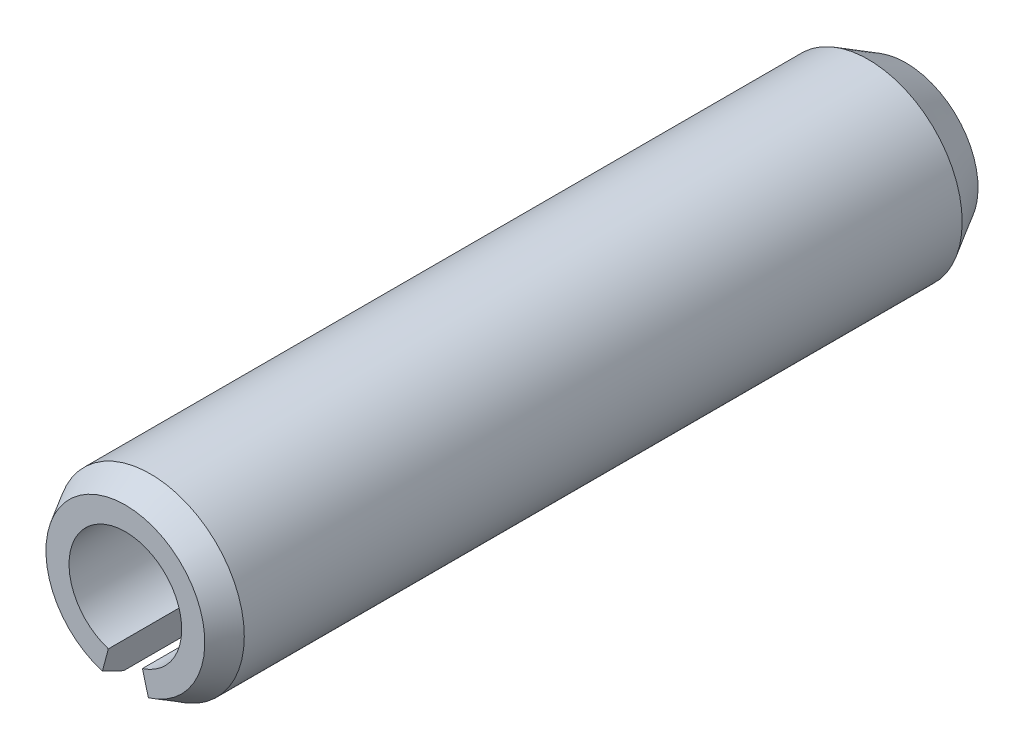
ISO-10303-21;
HEADER;
FILE_DESCRIPTION(('STEP AP214'),'2;1');
FILE_NAME('part.step','',(''),(''),'','','');
FILE_SCHEMA(('AUTOMOTIVE_DESIGN { 1 0 10303 214 1 1 1 1 }'));
ENDSEC;
DATA;
#1=APPLICATION_CONTEXT('core data for automotive mechanical design processes');
#2=APPLICATION_PROTOCOL_DEFINITION('international standard','automotive_design',2000,#1);
#3=PRODUCT_CONTEXT('',#1,'mechanical');
#4=PRODUCT('Part','Part','',(#3));
#5=PRODUCT_RELATED_PRODUCT_CATEGORY('part','',(#4));
#6=PRODUCT_DEFINITION_FORMATION('','',#4);
#7=PRODUCT_DEFINITION_CONTEXT('part definition',#1,'design');
#8=PRODUCT_DEFINITION('design','',#6,#7);
#9=PRODUCT_DEFINITION_SHAPE('','',#8);
#10=(LENGTH_UNIT() NAMED_UNIT(*) SI_UNIT(.MILLI.,.METRE.));
#11=(NAMED_UNIT(*) PLANE_ANGLE_UNIT() SI_UNIT($,.RADIAN.));
#12=(NAMED_UNIT(*) SI_UNIT($,.STERADIAN.) SOLID_ANGLE_UNIT());
#13=UNCERTAINTY_MEASURE_WITH_UNIT(LENGTH_MEASURE(1.E-05),#10,'distance_accuracy_value','');
#14=(GEOMETRIC_REPRESENTATION_CONTEXT(3) GLOBAL_UNCERTAINTY_ASSIGNED_CONTEXT((#13)) GLOBAL_UNIT_ASSIGNED_CONTEXT((#10,
#11,#12)) REPRESENTATION_CONTEXT('',''));
#15=CARTESIAN_POINT('',(0.,0.,0.));
#16=DIRECTION('',(0.,0.,1.));
#17=DIRECTION('',(1.,0.,0.));
#18=AXIS2_PLACEMENT_3D('',#15,#16,#17);
#19=CARTESIAN_POINT('',(0.,0.,25.));
#20=DIRECTION('',(0.,0.,-1.));
#21=DIRECTION('',(-1.,0.,0.));
#22=AXIS2_PLACEMENT_3D('',#19,#20,#21);
#23=CYLINDRICAL_SURFACE('',#22,3.);
#24=DIRECTION('',(0.,0.,-1.));
#25=VECTOR('',#24,1.);
#26=CARTESIAN_POINT('',(0.85488871162423,-2.8756156368224,25.));
#27=LINE('',#26,#25);
#28=CARTESIAN_POINT('',(0.85488871162423,-2.8756156368224,24.2));
#29=VERTEX_POINT('',#28);
#30=CARTESIAN_POINT('',(0.85488871162423,-2.8756156368224,1.26188021535174));
#31=VERTEX_POINT('',#30);
#32=EDGE_CURVE('E128',#29,#31,#27,.T.);
#33=ORIENTED_EDGE('',*,*,#32,.T.);
#34=CARTESIAN_POINT('',(0.,0.,1.26188021535174));
#35=DIRECTION('',(0.,0.,-1.));
#36=DIRECTION('',(-1.,0.,0.));
#37=AXIS2_PLACEMENT_3D('',#34,#35,#36);
#38=CIRCLE('',#37,3.);
#39=CARTESIAN_POINT('',(-0.85488871162424,-2.87561563682241,1.26188021535174));
#40=VERTEX_POINT('',#39);
#41=EDGE_CURVE('E181',#31,#40,#38,.F.);
#42=ORIENTED_EDGE('',*,*,#41,.T.);
#43=DIRECTION('',(0.,0.,-1.));
#44=VECTOR('',#43,1.);
#45=CARTESIAN_POINT('',(-0.85488871162424,-2.87561563682241,25.));
#46=LINE('',#45,#44);
#47=CARTESIAN_POINT('',(-0.85488871162424,-2.87561563682241,24.2));
#48=VERTEX_POINT('',#47);
#49=EDGE_CURVE('E107',#48,#40,#46,.T.);
#50=ORIENTED_EDGE('',*,*,#49,.F.);
#51=CARTESIAN_POINT('',(0.,0.,24.2));
#52=DIRECTION('',(0.,0.,1.));
#53=DIRECTION('',(1.,0.,0.));
#54=AXIS2_PLACEMENT_3D('',#51,#52,#53);
#55=CIRCLE('',#54,3.);
#56=EDGE_CURVE('E143',#48,#29,#55,.F.);
#57=ORIENTED_EDGE('',*,*,#56,.T.);
#58=EDGE_LOOP('',(#33,#42,#50,#57));
#59=FACE_BOUND('',#58,.T.);
#60=ADVANCED_FACE('F32',(#59),#23,.T.);
#61=CARTESIAN_POINT('',(-0.544114673264127,-1.71579113598909,25.));
#62=DIRECTION('',(0.965925826289069,-0.258819045102521,0.));
#63=DIRECTION('',(0.258819045102521,0.965925826289069,0.));
#64=AXIS2_PLACEMENT_3D('',#61,#62,#63);
#65=PLANE('',#64);
#66=ORIENTED_EDGE('',*,*,#49,.T.);
#67=CARTESIAN_POINT('',(-0.85488871162424,-2.87561563682241,1.26188021535174));
#68=CARTESIAN_POINT('',(-0.824991324845767,-2.76403707035159,1.06187394169725));
#69=CARTESIAN_POINT('',(-0.795092532536618,-2.65245325836889,0.861870804879628));
#70=CARTESIAN_POINT('',(-0.735292136851209,-2.42927514335823,0.461870804879614));
#71=CARTESIAN_POINT('',(-0.70539053347495,-2.31768084033027,0.261873941697224));
#72=CARTESIAN_POINT('',(-0.675487524568013,-2.20608129179042,0.061880215351702));
#73=B_SPLINE_CURVE_WITH_KNOTS('',3,(#67,#68,#69,#70,#71,#72),.UNSPECIFIED.,.F.,.F.,(4,2,4),(0.,
0.692903497274497,1.38580699468237),.UNSPECIFIED.);
#74=CARTESIAN_POINT('',(-0.675487524568013,-2.20608129179042,0.061880215351702));
#75=VERTEX_POINT('',#74);
#76=EDGE_CURVE('E61',#40,#75,#73,.T.);
#77=ORIENTED_EDGE('',*,*,#76,.T.);
#78=CARTESIAN_POINT('',(-0.85488871162424,-2.87561563682241,0.46188021535171));
#79=CARTESIAN_POINT('',(-0.820363465807382,-2.74676566529007,0.384891229899427));
#80=CARTESIAN_POINT('',(-0.785837551663028,-2.61791319952558,0.307906719233972));
#81=CARTESIAN_POINT('',(-0.716784386707371,-2.36020327948764,0.153946647450066));
#82=CARTESIAN_POINT('',(-0.682257135896068,-2.23134582521419,0.0769710863316175));
#83=CARTESIAN_POINT('',(-0.647729216757268,-2.10248587670857,0.));
#84=B_SPLINE_CURVE_WITH_KNOTS('',3,(#78,#79,#80,#81,#82,#83),.UNSPECIFIED.,.F.,.F.,(4,2,4),(0.,
0.462054654853131,0.924109309866234),.UNSPECIFIED.);
#85=CARTESIAN_POINT('',(-0.647729216757268,-2.10248587670857,0.));
#86=VERTEX_POINT('',#85);
#87=EDGE_CURVE('E112',#75,#86,#84,.T.);
#88=ORIENTED_EDGE('',*,*,#87,.T.);
#89=DIRECTION('',(-0.258819045102521,-0.965925826289069,0.));
#90=VECTOR('',#89,1.);
#91=CARTESIAN_POINT('',(-0.544114673264127,-1.71579113598909,0.));
#92=LINE('',#91,#90);
#93=CARTESIAN_POINT('',(-0.544114673264109,-1.71579113598908,0.));
#94=VERTEX_POINT('',#93);
#95=EDGE_CURVE('E111',#94,#86,#92,.T.);
#96=ORIENTED_EDGE('',*,*,#95,.F.);
#97=DIRECTION('',(0.,0.,-1.));
#98=VECTOR('',#97,1.);
#99=CARTESIAN_POINT('',(-0.544114673264109,-1.71579113598908,25.));
#100=LINE('',#99,#98);
#101=CARTESIAN_POINT('',(-0.544114673264109,-1.71579113598908,25.));
#102=VERTEX_POINT('',#101);
#103=EDGE_CURVE('E97',#102,#94,#100,.T.);
#104=ORIENTED_EDGE('',*,*,#103,.F.);
#105=DIRECTION('',(-0.258819045102521,-0.965925826289069,0.));
#106=VECTOR('',#105,1.);
#107=CARTESIAN_POINT('',(-0.544114673264127,-1.71579113598909,25.));
#108=LINE('',#107,#106);
#109=CARTESIAN_POINT('',(-0.735293146523919,-2.42927891150812,25.));
#110=VERTEX_POINT('',#109);
#111=EDGE_CURVE('E120',#102,#110,#108,.T.);
#112=ORIENTED_EDGE('',*,*,#111,.T.);
#113=CARTESIAN_POINT('',(-0.735293146523919,-2.42927891150812,25.));
#114=CARTESIAN_POINT('',(-0.755226828903657,-2.50367242693122,24.866669095173));
#115=CARTESIAN_POINT('',(-0.775159967185426,-2.57806391175306,24.7333369760914));
#116=CARTESIAN_POINT('',(-0.815025155552199,-2.72684282019116,24.4666703094247));
#117=CARTESIAN_POINT('',(-0.834957205637204,-2.80123024380741,24.3333357618396));
#118=CARTESIAN_POINT('',(-0.85488871162424,-2.87561563682241,24.2));
#119=B_SPLINE_CURVE_WITH_KNOTS('',3,(#113,#114,#115,#116,#117,#118),.UNSPECIFIED.,.F.,.F.,(4,2,
4),(0.,0.46193061486643,0.923861229713709),.UNSPECIFIED.);
#120=EDGE_CURVE('E136',#110,#48,#119,.T.);
#121=ORIENTED_EDGE('',*,*,#120,.T.);
#122=EDGE_LOOP('',(#66,#77,#88,#96,#104,#112,#121));
#123=FACE_BOUND('',#122,.T.);
#124=ADVANCED_FACE('F34',(#123),#65,.T.);
#125=CARTESIAN_POINT('',(0.,0.,25.));
#126=DIRECTION('',(0.,0.,-1.));
#127=DIRECTION('',(-1.,0.,0.));
#128=AXIS2_PLACEMENT_3D('',#125,#126,#127);
#129=CYLINDRICAL_SURFACE('',#128,1.8);
#130=DIRECTION('',(0.,0.,-1.));
#131=VECTOR('',#130,1.);
#132=CARTESIAN_POINT('',(0.544114673264102,-1.71579113598908,25.));
#133=LINE('',#132,#131);
#134=CARTESIAN_POINT('',(0.544114673264102,-1.71579113598908,25.));
#135=VERTEX_POINT('',#134);
#136=CARTESIAN_POINT('',(0.544114673264102,-1.71579113598908,0.));
#137=VERTEX_POINT('',#136);
#138=EDGE_CURVE('E108',#135,#137,#133,.T.);
#139=ORIENTED_EDGE('',*,*,#138,.F.);
#140=CARTESIAN_POINT('',(0.,0.,25.));
#141=DIRECTION('',(0.,0.,1.));
#142=DIRECTION('',(1.,0.,0.));
#143=AXIS2_PLACEMENT_3D('',#140,#141,#142);
#144=CIRCLE('',#143,1.8);
#145=EDGE_CURVE('E104',#135,#102,#144,.T.);
#146=ORIENTED_EDGE('',*,*,#145,.T.);
#147=ORIENTED_EDGE('',*,*,#103,.T.);
#148=CARTESIAN_POINT('',(0.,0.,0.));
#149=DIRECTION('',(0.,0.,1.));
#150=DIRECTION('',(1.,0.,0.));
#151=AXIS2_PLACEMENT_3D('',#148,#149,#150);
#152=CIRCLE('',#151,1.8);
#153=EDGE_CURVE('E101',#137,#94,#152,.T.);
#154=ORIENTED_EDGE('',*,*,#153,.F.);
#155=EDGE_LOOP('',(#139,#146,#147,#154));
#156=FACE_BOUND('',#155,.T.);
#157=ADVANCED_FACE('F99',(#156),#129,.F.);
#158=CARTESIAN_POINT('',(0.544114673264102,-1.71579113598908,25.));
#159=DIRECTION('',(0.965925826289068,0.258819045102521,0.));
#160=DIRECTION('',(-0.258819045102521,0.965925826289068,0.));
#161=AXIS2_PLACEMENT_3D('',#158,#159,#160);
#162=PLANE('',#161);
#163=CARTESIAN_POINT('',(0.647729216757258,-2.10248587670857,0.));
#164=CARTESIAN_POINT('',(0.68225713589605,-2.23134582521419,0.0769710863316155));
#165=CARTESIAN_POINT('',(0.716784386707349,-2.36020327948764,0.153946647450063));
#166=CARTESIAN_POINT('',(0.785837551663006,-2.61791319952558,0.307906719233969));
#167=CARTESIAN_POINT('',(0.820363465807364,-2.74676566529007,0.384891229899425));
#168=CARTESIAN_POINT('',(0.85488871162423,-2.8756156368224,0.46188021535171));
#169=B_SPLINE_CURVE_WITH_KNOTS('',3,(#163,#164,#165,#166,#167,#168),.UNSPECIFIED.,.F.,.F.,(4,2,
4),(0.,0.4620546550131,0.924109309866228),.UNSPECIFIED.);
#170=CARTESIAN_POINT('',(0.647729216757258,-2.10248587670857,0.));
#171=VERTEX_POINT('',#170);
#172=CARTESIAN_POINT('',(0.675487524568009,-2.20608129179042,0.061880215351702));
#173=VERTEX_POINT('',#172);
#174=EDGE_CURVE('E175',#171,#173,#169,.T.);
#175=ORIENTED_EDGE('',*,*,#174,.T.);
#176=CARTESIAN_POINT('',(0.675487524568009,-2.20608129179042,0.061880215351702));
#177=CARTESIAN_POINT('',(0.705390533474936,-2.31768084033027,0.261873941697223));
#178=CARTESIAN_POINT('',(0.735292136851189,-2.42927514335824,0.461870804879611));
#179=CARTESIAN_POINT('',(0.795092532536595,-2.6524532583689,0.861870804879625));
#180=CARTESIAN_POINT('',(0.824991324845749,-2.76403707035159,1.06187394169725));
#181=CARTESIAN_POINT('',(0.85488871162423,-2.8756156368224,1.26188021535174));
#182=B_SPLINE_CURVE_WITH_KNOTS('',3,(#176,#177,#178,#179,#180,#181),.UNSPECIFIED.,.F.,.F.,(4,2,
4),(0.,0.692903497407875,1.38580699468237),.UNSPECIFIED.);
#183=EDGE_CURVE('E11',#173,#31,#182,.T.);
#184=ORIENTED_EDGE('',*,*,#183,.T.);
#185=ORIENTED_EDGE('',*,*,#32,.F.);
#186=CARTESIAN_POINT('',(0.85488871162423,-2.8756156368224,24.2));
#187=CARTESIAN_POINT('',(0.834957205637186,-2.80123024380741,24.3333357618396));
#188=CARTESIAN_POINT('',(0.815025155552177,-2.72684282019116,24.4666703094247));
#189=CARTESIAN_POINT('',(0.775159967185405,-2.57806391175307,24.7333369760914));
#190=CARTESIAN_POINT('',(0.755226828903641,-2.50367242693122,24.866669095173));
#191=CARTESIAN_POINT('',(0.735293146523913,-2.42927891150811,25.));
#192=B_SPLINE_CURVE_WITH_KNOTS('',3,(#186,#187,#188,#189,#190,#191),.UNSPECIFIED.,.F.,.F.,(4,2,
4),(0.,0.461930614847278,0.923861229713708),.UNSPECIFIED.);
#193=CARTESIAN_POINT('',(0.735293146523913,-2.42927891150811,25.));
#194=VERTEX_POINT('',#193);
#195=EDGE_CURVE('E155',#29,#194,#192,.T.);
#196=ORIENTED_EDGE('',*,*,#195,.T.);
#197=DIRECTION('',(0.258819045102521,-0.965925826289068,0.));
#198=VECTOR('',#197,1.);
#199=CARTESIAN_POINT('',(0.544114673264102,-1.71579113598908,25.));
#200=LINE('',#199,#198);
#201=EDGE_CURVE('E125',#135,#194,#200,.T.);
#202=ORIENTED_EDGE('',*,*,#201,.F.);
#203=ORIENTED_EDGE('',*,*,#138,.T.);
#204=DIRECTION('',(0.258819045102521,-0.965925826289068,0.));
#205=VECTOR('',#204,1.);
#206=CARTESIAN_POINT('',(0.544114673264102,-1.71579113598908,0.));
#207=LINE('',#206,#205);
#208=EDGE_CURVE('E118',#137,#171,#207,.T.);
#209=ORIENTED_EDGE('',*,*,#208,.T.);
#210=EDGE_LOOP('',(#175,#184,#185,#196,#202,#203,#209));
#211=FACE_BOUND('',#210,.T.);
#212=ADVANCED_FACE('F166',(#211),#162,.F.);
#213=CARTESIAN_POINT('',(0.,0.,25.));
#214=DIRECTION('',(0.,0.,1.));
#215=DIRECTION('',(1.,0.,0.));
#216=AXIS2_PLACEMENT_3D('',#213,#214,#215);
#217=PLANE('',#216);
#218=ORIENTED_EDGE('',*,*,#201,.T.);
#219=CARTESIAN_POINT('',(0.,0.,25.));
#220=DIRECTION('',(0.,0.,1.));
#221=DIRECTION('',(1.,0.,0.));
#222=AXIS2_PLACEMENT_3D('',#219,#220,#221);
#223=CIRCLE('',#222,2.53811978464829);
#224=EDGE_CURVE('E133',#194,#110,#223,.T.);
#225=ORIENTED_EDGE('',*,*,#224,.T.);
#226=ORIENTED_EDGE('',*,*,#111,.F.);
#227=ORIENTED_EDGE('',*,*,#145,.F.);
#228=EDGE_LOOP('',(#218,#225,#226,#227));
#229=FACE_BOUND('',#228,.T.);
#230=ADVANCED_FACE('F170',(#229),#217,.T.);
#231=CARTESIAN_POINT('',(0.,0.,0.));
#232=DIRECTION('',(0.,0.,1.));
#233=DIRECTION('',(1.,0.,0.));
#234=AXIS2_PLACEMENT_3D('',#231,#232,#233);
#235=PLANE('',#234);
#236=ORIENTED_EDGE('',*,*,#95,.T.);
#237=CARTESIAN_POINT('',(0.,0.,0.));
#238=DIRECTION('',(0.,0.,1.));
#239=DIRECTION('',(1.,0.,0.));
#240=AXIS2_PLACEMENT_3D('',#237,#238,#239);
#241=CIRCLE('',#240,2.2);
#242=EDGE_CURVE('E182',#86,#171,#241,.F.);
#243=ORIENTED_EDGE('',*,*,#242,.T.);
#244=ORIENTED_EDGE('',*,*,#208,.F.);
#245=ORIENTED_EDGE('',*,*,#153,.T.);
#246=EDGE_LOOP('',(#236,#243,#244,#245));
#247=FACE_BOUND('',#246,.T.);
#248=ADVANCED_FACE('F116',(#247),#235,.F.);
#249=CARTESIAN_POINT('',(0.,0.,25.));
#250=DIRECTION('',(0.,0.,-1.));
#251=DIRECTION('',(-1.,0.,0.));
#252=AXIS2_PLACEMENT_3D('',#249,#250,#251);
#253=CONICAL_SURFACE('',#252,2.53811978464829,0.523598775598306);
#254=ORIENTED_EDGE('',*,*,#195,.F.);
#255=ORIENTED_EDGE('',*,*,#56,.F.);
#256=ORIENTED_EDGE('',*,*,#120,.F.);
#257=ORIENTED_EDGE('',*,*,#224,.F.);
#258=EDGE_LOOP('',(#254,#255,#256,#257));
#259=FACE_BOUND('',#258,.T.);
#260=ADVANCED_FACE('F145',(#259),#253,.T.);
#261=CARTESIAN_POINT('',(0.,0.,0.46188021535171));
#262=DIRECTION('',(0.,0.,1.));
#263=DIRECTION('',(1.,0.,0.));
#264=AXIS2_PLACEMENT_3D('',#261,#262,#263);
#265=CONICAL_SURFACE('',#264,3.,1.04719755119659);
#266=ORIENTED_EDGE('',*,*,#87,.F.);
#267=CARTESIAN_POINT('',(0.,0.,0.061880215351702));
#268=DIRECTION('',(0.,0.,1.));
#269=DIRECTION('',(1.,0.,0.));
#270=AXIS2_PLACEMENT_3D('',#267,#268,#269);
#271=CIRCLE('',#270,2.30717967697245);
#272=EDGE_CURVE('E47',#75,#173,#271,.F.);
#273=ORIENTED_EDGE('',*,*,#272,.T.);
#274=ORIENTED_EDGE('',*,*,#174,.F.);
#275=ORIENTED_EDGE('',*,*,#242,.F.);
#276=EDGE_LOOP('',(#266,#273,#274,#275));
#277=FACE_BOUND('',#276,.T.);
#278=ADVANCED_FACE('F150',(#277),#265,.T.);
#279=CARTESIAN_POINT('',(0.,0.,1.26188021535174));
#280=DIRECTION('',(0.,0.,1.));
#281=DIRECTION('',(1.,0.,0.));
#282=AXIS2_PLACEMENT_3D('',#279,#280,#281);
#283=CONICAL_SURFACE('',#282,3.,0.523598775598287);
#284=ORIENTED_EDGE('',*,*,#183,.F.);
#285=ORIENTED_EDGE('',*,*,#272,.F.);
#286=ORIENTED_EDGE('',*,*,#76,.F.);
#287=ORIENTED_EDGE('',*,*,#41,.F.);
#288=EDGE_LOOP('',(#284,#285,#286,#287));
#289=FACE_BOUND('',#288,.T.);
#290=ADVANCED_FACE('F189',(#289),#283,.T.);
#291=CLOSED_SHELL('',(#60,#124,#157,#212,#230,#248,#260,#278,#290));
#292=MANIFOLD_SOLID_BREP('B2',#291);
#293=ADVANCED_BREP_SHAPE_REPRESENTATION('',(#18,#292),#14);
#294=SHAPE_DEFINITION_REPRESENTATION(#9,#293);
ENDSEC;
END-ISO-10303-21;
